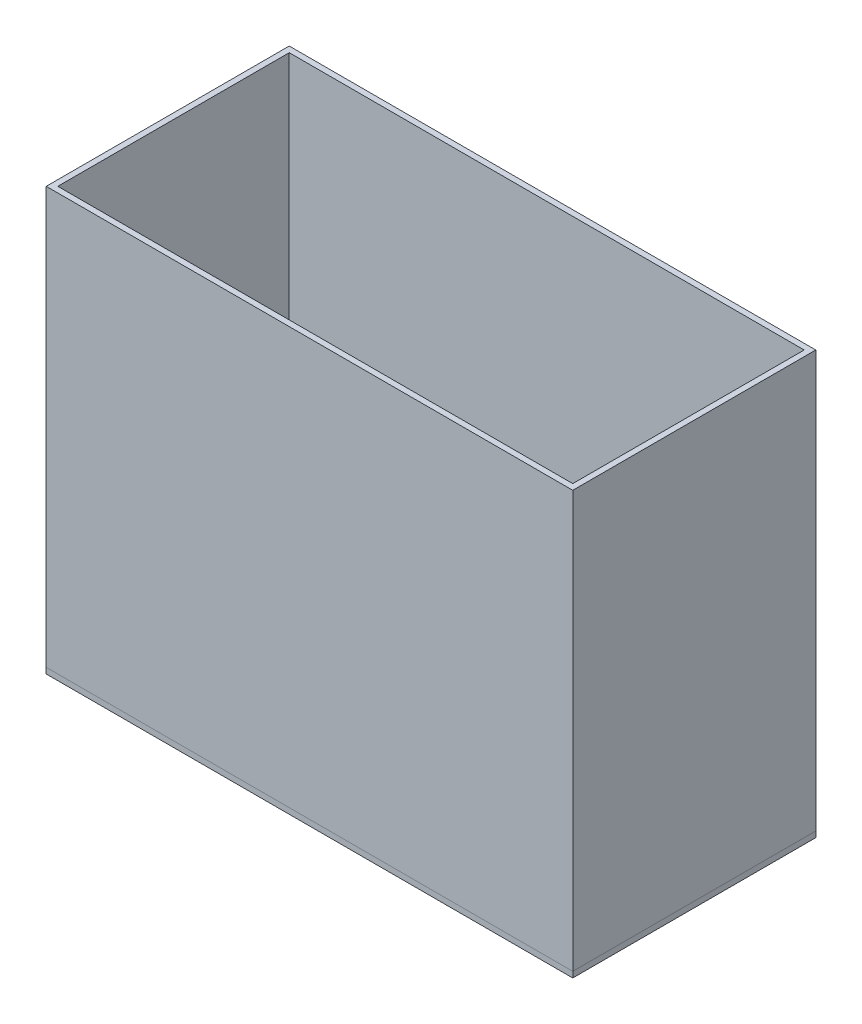
ISO-10303-21;
HEADER;
FILE_DESCRIPTION(('STEP AP214'),'2;1');
FILE_NAME('part.step','',(''),(''),'','','');
FILE_SCHEMA(('AUTOMOTIVE_DESIGN { 1 0 10303 214 1 1 1 1 }'));
ENDSEC;
DATA;
#1=APPLICATION_CONTEXT('core data for automotive mechanical design processes');
#2=APPLICATION_PROTOCOL_DEFINITION('international standard','automotive_design',2000,#1);
#3=PRODUCT_CONTEXT('',#1,'mechanical');
#4=PRODUCT('Part','Part','',(#3));
#5=PRODUCT_RELATED_PRODUCT_CATEGORY('part','',(#4));
#6=PRODUCT_DEFINITION_FORMATION('','',#4);
#7=PRODUCT_DEFINITION_CONTEXT('part definition',#1,'design');
#8=PRODUCT_DEFINITION('design','',#6,#7);
#9=PRODUCT_DEFINITION_SHAPE('','',#8);
#10=(LENGTH_UNIT() NAMED_UNIT(*) SI_UNIT(.MILLI.,.METRE.));
#11=(NAMED_UNIT(*) PLANE_ANGLE_UNIT() SI_UNIT($,.RADIAN.));
#12=(NAMED_UNIT(*) SI_UNIT($,.STERADIAN.) SOLID_ANGLE_UNIT());
#13=UNCERTAINTY_MEASURE_WITH_UNIT(LENGTH_MEASURE(1.E-05),#10,'distance_accuracy_value','');
#14=(GEOMETRIC_REPRESENTATION_CONTEXT(3) GLOBAL_UNCERTAINTY_ASSIGNED_CONTEXT((#13)) GLOBAL_UNIT_ASSIGNED_CONTEXT((#10,
#11,#12)) REPRESENTATION_CONTEXT('',''));
#15=CARTESIAN_POINT('',(0.,0.,0.));
#16=DIRECTION('',(0.,0.,1.));
#17=DIRECTION('',(1.,0.,0.));
#18=AXIS2_PLACEMENT_3D('',#15,#16,#17);
#19=CARTESIAN_POINT('',(-230.,-5.,-100.));
#20=DIRECTION('',(-1.,0.,0.));
#21=DIRECTION('',(0.,0.,1.));
#22=AXIS2_PLACEMENT_3D('',#19,#20,#21);
#23=PLANE('',#22);
#24=DIRECTION('',(0.,0.,1.));
#25=VECTOR('',#24,1.);
#26=CARTESIAN_POINT('',(-230.,0.,-100.));
#27=LINE('',#26,#25);
#28=CARTESIAN_POINT('',(-230.,0.,-100.));
#29=VERTEX_POINT('',#28);
#30=CARTESIAN_POINT('',(-230.,0.,110.));
#31=VERTEX_POINT('',#30);
#32=EDGE_CURVE('E113',#29,#31,#27,.T.);
#33=ORIENTED_EDGE('',*,*,#32,.F.);
#34=DIRECTION('',(0.,1.,0.));
#35=VECTOR('',#34,1.);
#36=CARTESIAN_POINT('',(-230.,-5.,-100.));
#37=LINE('',#36,#35);
#38=CARTESIAN_POINT('',(-230.,-5.,-100.));
#39=VERTEX_POINT('',#38);
#40=EDGE_CURVE('E12',#39,#29,#37,.T.);
#41=ORIENTED_EDGE('',*,*,#40,.F.);
#42=DIRECTION('',(0.,0.,1.));
#43=VECTOR('',#42,1.);
#44=CARTESIAN_POINT('',(-230.,-5.,-100.));
#45=LINE('',#44,#43);
#46=CARTESIAN_POINT('',(-230.,-5.,110.));
#47=VERTEX_POINT('',#46);
#48=EDGE_CURVE('E107',#39,#47,#45,.T.);
#49=ORIENTED_EDGE('',*,*,#48,.T.);
#50=DIRECTION('',(0.,1.,0.));
#51=VECTOR('',#50,1.);
#52=CARTESIAN_POINT('',(-230.,-5.,110.));
#53=LINE('',#52,#51);
#54=EDGE_CURVE('E52',#47,#31,#53,.T.);
#55=ORIENTED_EDGE('',*,*,#54,.T.);
#56=EDGE_LOOP('',(#33,#41,#49,#55));
#57=FACE_BOUND('',#56,.T.);
#58=ADVANCED_FACE('F49',(#57),#23,.T.);
#59=CARTESIAN_POINT('',(-230.,-5.,-100.));
#60=DIRECTION('',(0.,0.,-1.));
#61=DIRECTION('',(-1.,0.,0.));
#62=AXIS2_PLACEMENT_3D('',#59,#60,#61);
#63=PLANE('',#62);
#64=DIRECTION('',(-1.,0.,0.));
#65=VECTOR('',#64,1.);
#66=CARTESIAN_POINT('',(-230.,0.,-100.));
#67=LINE('',#66,#65);
#68=CARTESIAN_POINT('',(225.,0.,-100.));
#69=VERTEX_POINT('',#68);
#70=EDGE_CURVE('E109',#69,#29,#67,.T.);
#71=ORIENTED_EDGE('',*,*,#70,.F.);
#72=DIRECTION('',(0.,1.,0.));
#73=VECTOR('',#72,1.);
#74=CARTESIAN_POINT('',(225.,-5.,-100.));
#75=LINE('',#74,#73);
#76=CARTESIAN_POINT('',(225.,-5.,-100.));
#77=VERTEX_POINT('',#76);
#78=EDGE_CURVE('E58',#77,#69,#75,.T.);
#79=ORIENTED_EDGE('',*,*,#78,.F.);
#80=DIRECTION('',(-1.,0.,0.));
#81=VECTOR('',#80,1.);
#82=CARTESIAN_POINT('',(-230.,-5.,-100.));
#83=LINE('',#82,#81);
#84=EDGE_CURVE('E104',#77,#39,#83,.T.);
#85=ORIENTED_EDGE('',*,*,#84,.T.);
#86=ORIENTED_EDGE('',*,*,#40,.T.);
#87=EDGE_LOOP('',(#71,#79,#85,#86));
#88=FACE_BOUND('',#87,.T.);
#89=ADVANCED_FACE('F123',(#88),#63,.T.);
#90=CARTESIAN_POINT('',(225.,-5.,-100.));
#91=DIRECTION('',(1.,0.,0.));
#92=DIRECTION('',(0.,0.,-1.));
#93=AXIS2_PLACEMENT_3D('',#90,#91,#92);
#94=PLANE('',#93);
#95=DIRECTION('',(0.,0.,-1.));
#96=VECTOR('',#95,1.);
#97=CARTESIAN_POINT('',(225.,0.,-100.));
#98=LINE('',#97,#96);
#99=CARTESIAN_POINT('',(225.,0.,110.));
#100=VERTEX_POINT('',#99);
#101=EDGE_CURVE('E99',#100,#69,#98,.T.);
#102=ORIENTED_EDGE('',*,*,#101,.F.);
#103=DIRECTION('',(0.,1.,0.));
#104=VECTOR('',#103,1.);
#105=CARTESIAN_POINT('',(225.,-5.,110.));
#106=LINE('',#105,#104);
#107=CARTESIAN_POINT('',(225.,-5.,110.));
#108=VERTEX_POINT('',#107);
#109=EDGE_CURVE('E94',#108,#100,#106,.T.);
#110=ORIENTED_EDGE('',*,*,#109,.F.);
#111=DIRECTION('',(0.,0.,-1.));
#112=VECTOR('',#111,1.);
#113=CARTESIAN_POINT('',(225.,-5.,-100.));
#114=LINE('',#113,#112);
#115=EDGE_CURVE('E97',#108,#77,#114,.T.);
#116=ORIENTED_EDGE('',*,*,#115,.T.);
#117=ORIENTED_EDGE('',*,*,#78,.T.);
#118=EDGE_LOOP('',(#102,#110,#116,#117));
#119=FACE_BOUND('',#118,.T.);
#120=ADVANCED_FACE('F96',(#119),#94,.T.);
#121=CARTESIAN_POINT('',(-230.,-5.,110.));
#122=DIRECTION('',(0.,0.,1.));
#123=DIRECTION('',(1.,0.,0.));
#124=AXIS2_PLACEMENT_3D('',#121,#122,#123);
#125=PLANE('',#124);
#126=DIRECTION('',(1.,0.,0.));
#127=VECTOR('',#126,1.);
#128=CARTESIAN_POINT('',(-230.,0.,110.));
#129=LINE('',#128,#127);
#130=EDGE_CURVE('E116',#31,#100,#129,.T.);
#131=ORIENTED_EDGE('',*,*,#130,.F.);
#132=ORIENTED_EDGE('',*,*,#54,.F.);
#133=DIRECTION('',(1.,0.,0.));
#134=VECTOR('',#133,1.);
#135=CARTESIAN_POINT('',(-230.,-5.,110.));
#136=LINE('',#135,#134);
#137=EDGE_CURVE('E103',#47,#108,#136,.T.);
#138=ORIENTED_EDGE('',*,*,#137,.T.);
#139=ORIENTED_EDGE('',*,*,#109,.T.);
#140=EDGE_LOOP('',(#131,#132,#138,#139));
#141=FACE_BOUND('',#140,.T.);
#142=ADVANCED_FACE('F106',(#141),#125,.T.);
#143=CARTESIAN_POINT('',(0.,-5.,0.));
#144=DIRECTION('',(0.,1.,0.));
#145=DIRECTION('',(0.,0.,1.));
#146=AXIS2_PLACEMENT_3D('',#143,#144,#145);
#147=PLANE('',#146);
#148=ORIENTED_EDGE('',*,*,#48,.F.);
#149=ORIENTED_EDGE('',*,*,#84,.F.);
#150=ORIENTED_EDGE('',*,*,#115,.F.);
#151=ORIENTED_EDGE('',*,*,#137,.F.);
#152=EDGE_LOOP('',(#148,#149,#150,#151));
#153=FACE_BOUND('',#152,.T.);
#154=ADVANCED_FACE('F102',(#153),#147,.F.);
#155=CARTESIAN_POINT('',(0.,0.,0.));
#156=DIRECTION('',(0.,1.,0.));
#157=DIRECTION('',(0.,0.,1.));
#158=AXIS2_PLACEMENT_3D('',#155,#156,#157);
#159=PLANE('',#158);
#160=ORIENTED_EDGE('',*,*,#32,.T.);
#161=ORIENTED_EDGE('',*,*,#130,.T.);
#162=ORIENTED_EDGE('',*,*,#101,.T.);
#163=ORIENTED_EDGE('',*,*,#70,.T.);
#164=EDGE_LOOP('',(#160,#161,#162,#163));
#165=FACE_BOUND('',#164,.T.);
#166=ADVANCED_FACE('F122',(#165),#159,.T.);
#167=CLOSED_SHELL('',(#58,#89,#120,#142,#154,#166));
#168=MANIFOLD_SOLID_BREP('B2',#167);
#169=CARTESIAN_POINT('',(0.,360.,0.));
#170=DIRECTION('',(0.,1.,0.));
#171=DIRECTION('',(0.,0.,1.));
#172=AXIS2_PLACEMENT_3D('',#169,#170,#171);
#173=PLANE('',#172);
#174=DIRECTION('',(0.,0.,1.));
#175=VECTOR('',#174,1.);
#176=CARTESIAN_POINT('',(-230.,360.,-100.));
#177=LINE('',#176,#175);
#178=CARTESIAN_POINT('',(-230.,360.,-100.));
#179=VERTEX_POINT('',#178);
#180=CARTESIAN_POINT('',(-230.,360.,110.));
#181=VERTEX_POINT('',#180);
#182=EDGE_CURVE('E298',#179,#181,#177,.T.);
#183=ORIENTED_EDGE('',*,*,#182,.T.);
#184=DIRECTION('',(1.,0.,0.));
#185=VECTOR('',#184,1.);
#186=CARTESIAN_POINT('',(-230.,360.,110.));
#187=LINE('',#186,#185);
#188=CARTESIAN_POINT('',(225.,360.,110.));
#189=VERTEX_POINT('',#188);
#190=EDGE_CURVE('E301',#181,#189,#187,.T.);
#191=ORIENTED_EDGE('',*,*,#190,.T.);
#192=DIRECTION('',(0.,0.,-1.));
#193=VECTOR('',#192,1.);
#194=CARTESIAN_POINT('',(225.,360.,-100.));
#195=LINE('',#194,#193);
#196=CARTESIAN_POINT('',(225.,360.,-100.));
#197=VERTEX_POINT('',#196);
#198=EDGE_CURVE('E304',#189,#197,#195,.T.);
#199=ORIENTED_EDGE('',*,*,#198,.T.);
#200=DIRECTION('',(-1.,0.,0.));
#201=VECTOR('',#200,1.);
#202=CARTESIAN_POINT('',(-230.,360.,-100.));
#203=LINE('',#202,#201);
#204=EDGE_CURVE('E306',#197,#179,#203,.T.);
#205=ORIENTED_EDGE('',*,*,#204,.T.);
#206=EDGE_LOOP('',(#183,#191,#199,#205));
#207=FACE_BOUND('',#206,.T.);
#208=DIRECTION('',(1.,0.,0.));
#209=VECTOR('',#208,1.);
#210=CARTESIAN_POINT('',(-225.,360.,105.));
#211=LINE('',#210,#209);
#212=CARTESIAN_POINT('',(-225.,360.,105.));
#213=VERTEX_POINT('',#212);
#214=CARTESIAN_POINT('',(220.,360.,105.));
#215=VERTEX_POINT('',#214);
#216=EDGE_CURVE('E270',#213,#215,#211,.T.);
#217=ORIENTED_EDGE('',*,*,#216,.F.);
#218=DIRECTION('',(0.,0.,1.));
#219=VECTOR('',#218,1.);
#220=CARTESIAN_POINT('',(-225.,360.,-95.));
#221=LINE('',#220,#219);
#222=CARTESIAN_POINT('',(-225.,360.,-95.));
#223=VERTEX_POINT('',#222);
#224=EDGE_CURVE('E262',#223,#213,#221,.T.);
#225=ORIENTED_EDGE('',*,*,#224,.F.);
#226=DIRECTION('',(-1.,0.,0.));
#227=VECTOR('',#226,1.);
#228=CARTESIAN_POINT('',(-225.,360.,-95.));
#229=LINE('',#228,#227);
#230=CARTESIAN_POINT('',(220.,360.,-95.));
#231=VERTEX_POINT('',#230);
#232=EDGE_CURVE('E284',#231,#223,#229,.T.);
#233=ORIENTED_EDGE('',*,*,#232,.F.);
#234=DIRECTION('',(0.,0.,-1.));
#235=VECTOR('',#234,1.);
#236=CARTESIAN_POINT('',(220.,360.,-95.));
#237=LINE('',#236,#235);
#238=EDGE_CURVE('E282',#215,#231,#237,.T.);
#239=ORIENTED_EDGE('',*,*,#238,.F.);
#240=EDGE_LOOP('',(#217,#225,#233,#239));
#241=FACE_BOUND('',#240,.T.);
#242=ADVANCED_FACE('F197',(#207,#241),#173,.T.);
#243=CARTESIAN_POINT('',(0.,0.,0.));
#244=DIRECTION('',(0.,1.,0.));
#245=DIRECTION('',(0.,0.,1.));
#246=AXIS2_PLACEMENT_3D('',#243,#244,#245);
#247=PLANE('',#246);
#248=DIRECTION('',(0.,0.,1.));
#249=VECTOR('',#248,1.);
#250=CARTESIAN_POINT('',(-230.,0.,-100.));
#251=LINE('',#250,#249);
#252=CARTESIAN_POINT('',(-230.,0.,-100.));
#253=VERTEX_POINT('',#252);
#254=CARTESIAN_POINT('',(-230.,0.,110.));
#255=VERTEX_POINT('',#254);
#256=EDGE_CURVE('E278',#253,#255,#251,.T.);
#257=ORIENTED_EDGE('',*,*,#256,.F.);
#258=DIRECTION('',(-1.,0.,0.));
#259=VECTOR('',#258,1.);
#260=CARTESIAN_POINT('',(-230.,0.,-100.));
#261=LINE('',#260,#259);
#262=CARTESIAN_POINT('',(225.,0.,-100.));
#263=VERTEX_POINT('',#262);
#264=EDGE_CURVE('E302',#263,#253,#261,.T.);
#265=ORIENTED_EDGE('',*,*,#264,.F.);
#266=DIRECTION('',(0.,0.,-1.));
#267=VECTOR('',#266,1.);
#268=CARTESIAN_POINT('',(225.,0.,-100.));
#269=LINE('',#268,#267);
#270=CARTESIAN_POINT('',(225.,0.,110.));
#271=VERTEX_POINT('',#270);
#272=EDGE_CURVE('E313',#271,#263,#269,.T.);
#273=ORIENTED_EDGE('',*,*,#272,.F.);
#274=DIRECTION('',(1.,0.,0.));
#275=VECTOR('',#274,1.);
#276=CARTESIAN_POINT('',(-230.,0.,110.));
#277=LINE('',#276,#275);
#278=EDGE_CURVE('E311',#255,#271,#277,.T.);
#279=ORIENTED_EDGE('',*,*,#278,.F.);
#280=EDGE_LOOP('',(#257,#265,#273,#279));
#281=FACE_BOUND('',#280,.T.);
#282=DIRECTION('',(0.,0.,1.));
#283=VECTOR('',#282,1.);
#284=CARTESIAN_POINT('',(-225.,0.,-95.));
#285=LINE('',#284,#283);
#286=CARTESIAN_POINT('',(-225.,0.,-95.));
#287=VERTEX_POINT('',#286);
#288=CARTESIAN_POINT('',(-225.,0.,105.));
#289=VERTEX_POINT('',#288);
#290=EDGE_CURVE('E220',#287,#289,#285,.T.);
#291=ORIENTED_EDGE('',*,*,#290,.T.);
#292=DIRECTION('',(1.,0.,0.));
#293=VECTOR('',#292,1.);
#294=CARTESIAN_POINT('',(-225.,0.,105.));
#295=LINE('',#294,#293);
#296=CARTESIAN_POINT('',(220.,0.,105.));
#297=VERTEX_POINT('',#296);
#298=EDGE_CURVE('E277',#289,#297,#295,.T.);
#299=ORIENTED_EDGE('',*,*,#298,.T.);
#300=DIRECTION('',(0.,0.,-1.));
#301=VECTOR('',#300,1.);
#302=CARTESIAN_POINT('',(220.,0.,-95.));
#303=LINE('',#302,#301);
#304=CARTESIAN_POINT('',(220.,0.,-95.));
#305=VERTEX_POINT('',#304);
#306=EDGE_CURVE('E290',#297,#305,#303,.T.);
#307=ORIENTED_EDGE('',*,*,#306,.T.);
#308=DIRECTION('',(-1.,0.,0.));
#309=VECTOR('',#308,1.);
#310=CARTESIAN_POINT('',(-225.,0.,-95.));
#311=LINE('',#310,#309);
#312=EDGE_CURVE('E271',#305,#287,#311,.T.);
#313=ORIENTED_EDGE('',*,*,#312,.T.);
#314=EDGE_LOOP('',(#291,#299,#307,#313));
#315=FACE_BOUND('',#314,.T.);
#316=ADVANCED_FACE('F331',(#281,#315),#247,.F.);
#317=CARTESIAN_POINT('',(-230.,360.,-100.));
#318=DIRECTION('',(1.,0.,0.));
#319=DIRECTION('',(0.,0.,-1.));
#320=AXIS2_PLACEMENT_3D('',#317,#318,#319);
#321=PLANE('',#320);
#322=ORIENTED_EDGE('',*,*,#256,.T.);
#323=DIRECTION('',(0.,-1.,0.));
#324=VECTOR('',#323,1.);
#325=CARTESIAN_POINT('',(-230.,360.,110.));
#326=LINE('',#325,#324);
#327=EDGE_CURVE('E47',#181,#255,#326,.T.);
#328=ORIENTED_EDGE('',*,*,#327,.F.);
#329=ORIENTED_EDGE('',*,*,#182,.F.);
#330=DIRECTION('',(0.,-1.,0.));
#331=VECTOR('',#330,1.);
#332=CARTESIAN_POINT('',(-230.,360.,-100.));
#333=LINE('',#332,#331);
#334=EDGE_CURVE('E308',#179,#253,#333,.T.);
#335=ORIENTED_EDGE('',*,*,#334,.T.);
#336=EDGE_LOOP('',(#322,#328,#329,#335));
#337=FACE_BOUND('',#336,.T.);
#338=ADVANCED_FACE('F199',(#337),#321,.F.);
#339=CARTESIAN_POINT('',(-230.,360.,110.));
#340=DIRECTION('',(0.,0.,-1.));
#341=DIRECTION('',(-1.,0.,0.));
#342=AXIS2_PLACEMENT_3D('',#339,#340,#341);
#343=PLANE('',#342);
#344=ORIENTED_EDGE('',*,*,#278,.T.);
#345=DIRECTION('',(0.,-1.,0.));
#346=VECTOR('',#345,1.);
#347=CARTESIAN_POINT('',(225.,360.,110.));
#348=LINE('',#347,#346);
#349=EDGE_CURVE('E205',#189,#271,#348,.T.);
#350=ORIENTED_EDGE('',*,*,#349,.F.);
#351=ORIENTED_EDGE('',*,*,#190,.F.);
#352=ORIENTED_EDGE('',*,*,#327,.T.);
#353=EDGE_LOOP('',(#344,#350,#351,#352));
#354=FACE_BOUND('',#353,.T.);
#355=ADVANCED_FACE('F341',(#354),#343,.F.);
#356=CARTESIAN_POINT('',(225.,360.,-100.));
#357=DIRECTION('',(-1.,0.,0.));
#358=DIRECTION('',(0.,0.,1.));
#359=AXIS2_PLACEMENT_3D('',#356,#357,#358);
#360=PLANE('',#359);
#361=ORIENTED_EDGE('',*,*,#272,.T.);
#362=DIRECTION('',(0.,-1.,0.));
#363=VECTOR('',#362,1.);
#364=CARTESIAN_POINT('',(225.,360.,-100.));
#365=LINE('',#364,#363);
#366=EDGE_CURVE('E318',#197,#263,#365,.T.);
#367=ORIENTED_EDGE('',*,*,#366,.F.);
#368=ORIENTED_EDGE('',*,*,#198,.F.);
#369=ORIENTED_EDGE('',*,*,#349,.T.);
#370=EDGE_LOOP('',(#361,#367,#368,#369));
#371=FACE_BOUND('',#370,.T.);
#372=ADVANCED_FACE('F325',(#371),#360,.F.);
#373=CARTESIAN_POINT('',(-230.,360.,-100.));
#374=DIRECTION('',(0.,0.,1.));
#375=DIRECTION('',(1.,0.,0.));
#376=AXIS2_PLACEMENT_3D('',#373,#374,#375);
#377=PLANE('',#376);
#378=ORIENTED_EDGE('',*,*,#264,.T.);
#379=ORIENTED_EDGE('',*,*,#334,.F.);
#380=ORIENTED_EDGE('',*,*,#204,.F.);
#381=ORIENTED_EDGE('',*,*,#366,.T.);
#382=EDGE_LOOP('',(#378,#379,#380,#381));
#383=FACE_BOUND('',#382,.T.);
#384=ADVANCED_FACE('F335',(#383),#377,.F.);
#385=CARTESIAN_POINT('',(-225.,360.,-95.));
#386=DIRECTION('',(1.,0.,0.));
#387=DIRECTION('',(0.,0.,-1.));
#388=AXIS2_PLACEMENT_3D('',#385,#386,#387);
#389=PLANE('',#388);
#390=ORIENTED_EDGE('',*,*,#290,.F.);
#391=DIRECTION('',(0.,-1.,0.));
#392=VECTOR('',#391,1.);
#393=CARTESIAN_POINT('',(-225.,360.,-95.));
#394=LINE('',#393,#392);
#395=EDGE_CURVE('E266',#223,#287,#394,.T.);
#396=ORIENTED_EDGE('',*,*,#395,.F.);
#397=ORIENTED_EDGE('',*,*,#224,.T.);
#398=DIRECTION('',(0.,-1.,0.));
#399=VECTOR('',#398,1.);
#400=CARTESIAN_POINT('',(-225.,360.,105.));
#401=LINE('',#400,#399);
#402=EDGE_CURVE('E265',#213,#289,#401,.T.);
#403=ORIENTED_EDGE('',*,*,#402,.T.);
#404=EDGE_LOOP('',(#390,#396,#397,#403));
#405=FACE_BOUND('',#404,.T.);
#406=ADVANCED_FACE('F264',(#405),#389,.T.);
#407=CARTESIAN_POINT('',(-225.,360.,105.));
#408=DIRECTION('',(0.,0.,-1.));
#409=DIRECTION('',(-1.,0.,0.));
#410=AXIS2_PLACEMENT_3D('',#407,#408,#409);
#411=PLANE('',#410);
#412=ORIENTED_EDGE('',*,*,#298,.F.);
#413=ORIENTED_EDGE('',*,*,#402,.F.);
#414=ORIENTED_EDGE('',*,*,#216,.T.);
#415=DIRECTION('',(0.,-1.,0.));
#416=VECTOR('',#415,1.);
#417=CARTESIAN_POINT('',(220.,360.,105.));
#418=LINE('',#417,#416);
#419=EDGE_CURVE('E279',#215,#297,#418,.T.);
#420=ORIENTED_EDGE('',*,*,#419,.T.);
#421=EDGE_LOOP('',(#412,#413,#414,#420));
#422=FACE_BOUND('',#421,.T.);
#423=ADVANCED_FACE('F274',(#422),#411,.T.);
#424=CARTESIAN_POINT('',(220.,360.,-95.));
#425=DIRECTION('',(-1.,0.,0.));
#426=DIRECTION('',(0.,0.,1.));
#427=AXIS2_PLACEMENT_3D('',#424,#425,#426);
#428=PLANE('',#427);
#429=ORIENTED_EDGE('',*,*,#306,.F.);
#430=ORIENTED_EDGE('',*,*,#419,.F.);
#431=ORIENTED_EDGE('',*,*,#238,.T.);
#432=DIRECTION('',(0.,-1.,0.));
#433=VECTOR('',#432,1.);
#434=CARTESIAN_POINT('',(220.,360.,-95.));
#435=LINE('',#434,#433);
#436=EDGE_CURVE('E212',#231,#305,#435,.T.);
#437=ORIENTED_EDGE('',*,*,#436,.T.);
#438=EDGE_LOOP('',(#429,#430,#431,#437));
#439=FACE_BOUND('',#438,.T.);
#440=ADVANCED_FACE('F364',(#439),#428,.T.);
#441=CARTESIAN_POINT('',(-225.,360.,-95.));
#442=DIRECTION('',(0.,0.,1.));
#443=DIRECTION('',(1.,0.,0.));
#444=AXIS2_PLACEMENT_3D('',#441,#442,#443);
#445=PLANE('',#444);
#446=ORIENTED_EDGE('',*,*,#312,.F.);
#447=ORIENTED_EDGE('',*,*,#436,.F.);
#448=ORIENTED_EDGE('',*,*,#232,.T.);
#449=ORIENTED_EDGE('',*,*,#395,.T.);
#450=EDGE_LOOP('',(#446,#447,#448,#449));
#451=FACE_BOUND('',#450,.T.);
#452=ADVANCED_FACE('F368',(#451),#445,.T.);
#453=CLOSED_SHELL('',(#242,#316,#338,#355,#372,#384,#406,#423,#440,#452));
#454=MANIFOLD_SOLID_BREP('B6',#453);
#455=ADVANCED_BREP_SHAPE_REPRESENTATION('',(#18,#168,#454),#14);
#456=SHAPE_DEFINITION_REPRESENTATION(#9,#455);
ENDSEC;
END-ISO-10303-21;
